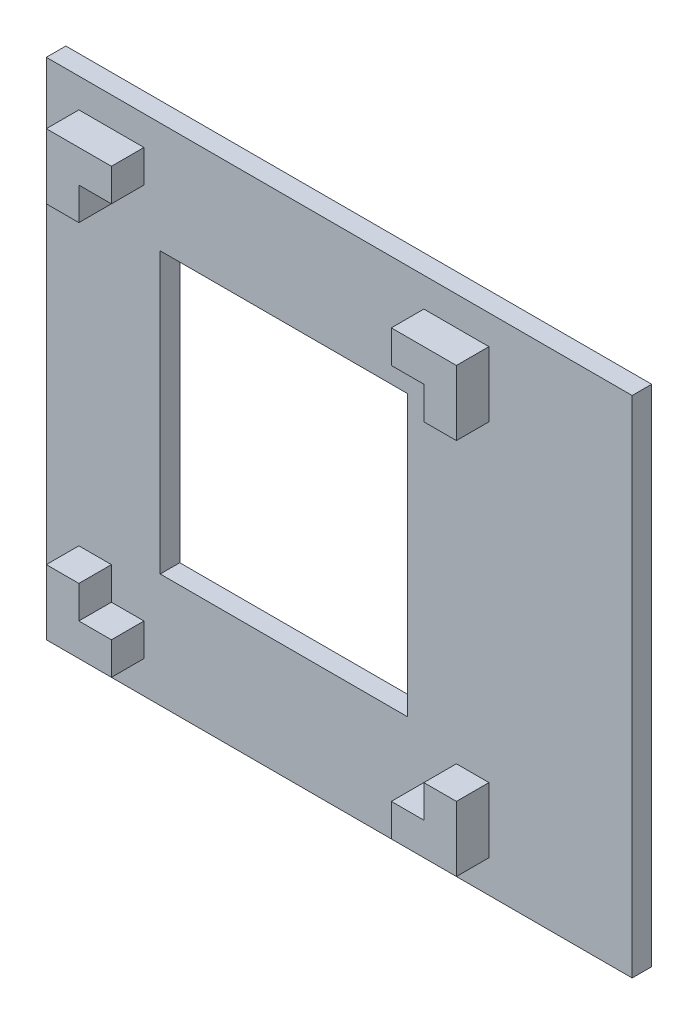
ISO-10303-21;
HEADER;
FILE_DESCRIPTION(('STEP AP214'),'2;1');
FILE_NAME('part.step','',(''),(''),'','','');
FILE_SCHEMA(('AUTOMOTIVE_DESIGN { 1 0 10303 214 1 1 1 1 }'));
ENDSEC;
DATA;
#1=APPLICATION_CONTEXT('core data for automotive mechanical design processes');
#2=APPLICATION_PROTOCOL_DEFINITION('international standard','automotive_design',2000,#1);
#3=PRODUCT_CONTEXT('',#1,'mechanical');
#4=PRODUCT('Part','Part','',(#3));
#5=PRODUCT_RELATED_PRODUCT_CATEGORY('part','',(#4));
#6=PRODUCT_DEFINITION_FORMATION('','',#4);
#7=PRODUCT_DEFINITION_CONTEXT('part definition',#1,'design');
#8=PRODUCT_DEFINITION('design','',#6,#7);
#9=PRODUCT_DEFINITION_SHAPE('','',#8);
#10=(LENGTH_UNIT() NAMED_UNIT(*) SI_UNIT(.MILLI.,.METRE.));
#11=(NAMED_UNIT(*) PLANE_ANGLE_UNIT() SI_UNIT($,.RADIAN.));
#12=(NAMED_UNIT(*) SI_UNIT($,.STERADIAN.) SOLID_ANGLE_UNIT());
#13=UNCERTAINTY_MEASURE_WITH_UNIT(LENGTH_MEASURE(1.E-05),#10,'distance_accuracy_value','');
#14=(GEOMETRIC_REPRESENTATION_CONTEXT(3) GLOBAL_UNCERTAINTY_ASSIGNED_CONTEXT((#13)) GLOBAL_UNIT_ASSIGNED_CONTEXT((#10,
#11,#12)) REPRESENTATION_CONTEXT('',''));
#15=CARTESIAN_POINT('',(0.,0.,0.));
#16=DIRECTION('',(0.,0.,1.));
#17=DIRECTION('',(1.,0.,0.));
#18=AXIS2_PLACEMENT_3D('',#15,#16,#17);
#19=CARTESIAN_POINT('',(0.,0.,3.));
#20=DIRECTION('',(0.,0.,1.));
#21=DIRECTION('',(1.,0.,0.));
#22=AXIS2_PLACEMENT_3D('',#19,#20,#21);
#23=PLANE('',#22);
#24=DIRECTION('',(1.,0.,0.));
#25=VECTOR('',#24,1.);
#26=CARTESIAN_POINT('',(0.,77.5,3.));
#27=LINE('',#26,#25);
#28=CARTESIAN_POINT('',(0.,77.5,3.));
#29=VERTEX_POINT('',#28);
#30=CARTESIAN_POINT('',(90.,77.5,3.));
#31=VERTEX_POINT('',#30);
#32=EDGE_CURVE('E376',#29,#31,#27,.T.);
#33=ORIENTED_EDGE('',*,*,#32,.F.);
#34=DIRECTION('',(0.,1.,0.));
#35=VECTOR('',#34,1.);
#36=CARTESIAN_POINT('',(0.,0.,3.));
#37=LINE('',#36,#35);
#38=CARTESIAN_POINT('',(0.,0.,3.));
#39=VERTEX_POINT('',#38);
#40=EDGE_CURVE('E379',#39,#29,#37,.T.);
#41=ORIENTED_EDGE('',*,*,#40,.F.);
#42=DIRECTION('',(1.,0.,0.));
#43=VECTOR('',#42,1.);
#44=CARTESIAN_POINT('',(0.,0.,3.));
#45=LINE('',#44,#43);
#46=CARTESIAN_POINT('',(90.,0.,3.));
#47=VERTEX_POINT('',#46);
#48=EDGE_CURVE('E383',#39,#47,#45,.T.);
#49=ORIENTED_EDGE('',*,*,#48,.T.);
#50=DIRECTION('',(0.,1.,0.));
#51=VECTOR('',#50,1.);
#52=CARTESIAN_POINT('',(90.,0.,3.));
#53=LINE('',#52,#51);
#54=EDGE_CURVE('E385',#47,#31,#53,.T.);
#55=ORIENTED_EDGE('',*,*,#54,.T.);
#56=EDGE_LOOP('',(#33,#41,#49,#55));
#57=FACE_BOUND('',#56,.T.);
#58=DIRECTION('',(0.,1.,0.));
#59=VECTOR('',#58,1.);
#60=CARTESIAN_POINT('',(15.,0.,3.));
#61=LINE('',#60,#59);
#62=CARTESIAN_POINT('',(15.,68.,3.));
#63=VERTEX_POINT('',#62);
#64=CARTESIAN_POINT('',(15.,73.,3.));
#65=VERTEX_POINT('',#64);
#66=EDGE_CURVE('E387',#63,#65,#61,.T.);
#67=ORIENTED_EDGE('',*,*,#66,.F.);
#68=DIRECTION('',(-1.,0.,0.));
#69=VECTOR('',#68,1.);
#70=CARTESIAN_POINT('',(0.,68.,3.));
#71=LINE('',#70,#69);
#72=CARTESIAN_POINT('',(10.,68.,3.));
#73=VERTEX_POINT('',#72);
#74=EDGE_CURVE('E390',#63,#73,#71,.T.);
#75=ORIENTED_EDGE('',*,*,#74,.T.);
#76=DIRECTION('',(0.,-1.,0.));
#77=VECTOR('',#76,1.);
#78=CARTESIAN_POINT('',(10.,0.,3.));
#79=LINE('',#78,#77);
#80=CARTESIAN_POINT('',(10.,63.,3.));
#81=VERTEX_POINT('',#80);
#82=EDGE_CURVE('E393',#73,#81,#79,.T.);
#83=ORIENTED_EDGE('',*,*,#82,.T.);
#84=DIRECTION('',(1.,0.,0.));
#85=VECTOR('',#84,1.);
#86=CARTESIAN_POINT('',(0.,63.,3.));
#87=LINE('',#86,#85);
#88=CARTESIAN_POINT('',(5.,63.,3.));
#89=VERTEX_POINT('',#88);
#90=EDGE_CURVE('E395',#89,#81,#87,.T.);
#91=ORIENTED_EDGE('',*,*,#90,.F.);
#92=DIRECTION('',(0.,-1.,0.));
#93=VECTOR('',#92,1.);
#94=CARTESIAN_POINT('',(5.,0.,3.));
#95=LINE('',#94,#93);
#96=CARTESIAN_POINT('',(5.,73.,3.));
#97=VERTEX_POINT('',#96);
#98=EDGE_CURVE('E398',#97,#89,#95,.T.);
#99=ORIENTED_EDGE('',*,*,#98,.F.);
#100=DIRECTION('',(-1.,0.,0.));
#101=VECTOR('',#100,1.);
#102=CARTESIAN_POINT('',(0.,73.,3.));
#103=LINE('',#102,#101);
#104=EDGE_CURVE('E401',#65,#97,#103,.T.);
#105=ORIENTED_EDGE('',*,*,#104,.F.);
#106=EDGE_LOOP('',(#67,#75,#83,#91,#99,#105));
#107=FACE_BOUND('',#106,.T.);
#108=DIRECTION('',(1.,0.,0.));
#109=VECTOR('',#108,1.);
#110=CARTESIAN_POINT('',(0.,10.,3.));
#111=LINE('',#110,#109);
#112=CARTESIAN_POINT('',(10.,10.,3.));
#113=VERTEX_POINT('',#112);
#114=CARTESIAN_POINT('',(15.,10.,3.));
#115=VERTEX_POINT('',#114);
#116=EDGE_CURVE('E404',#113,#115,#111,.T.);
#117=ORIENTED_EDGE('',*,*,#116,.T.);
#118=CARTESIAN_POINT('',(15.,5.,3.));
#119=VERTEX_POINT('',#118);
#120=EDGE_CURVE('E391',#119,#115,#61,.T.);
#121=ORIENTED_EDGE('',*,*,#120,.F.);
#122=DIRECTION('',(1.,0.,0.));
#123=VECTOR('',#122,1.);
#124=CARTESIAN_POINT('',(0.,5.,3.));
#125=LINE('',#124,#123);
#126=CARTESIAN_POINT('',(5.,5.,3.));
#127=VERTEX_POINT('',#126);
#128=EDGE_CURVE('E406',#127,#119,#125,.T.);
#129=ORIENTED_EDGE('',*,*,#128,.F.);
#130=DIRECTION('',(0.,1.,0.));
#131=VECTOR('',#130,1.);
#132=CARTESIAN_POINT('',(5.,0.,3.));
#133=LINE('',#132,#131);
#134=CARTESIAN_POINT('',(5.,15.,3.));
#135=VERTEX_POINT('',#134);
#136=EDGE_CURVE('E409',#127,#135,#133,.T.);
#137=ORIENTED_EDGE('',*,*,#136,.T.);
#138=DIRECTION('',(1.,0.,0.));
#139=VECTOR('',#138,1.);
#140=CARTESIAN_POINT('',(0.,15.,3.));
#141=LINE('',#140,#139);
#142=CARTESIAN_POINT('',(10.,15.,3.));
#143=VERTEX_POINT('',#142);
#144=EDGE_CURVE('E411',#135,#143,#141,.T.);
#145=ORIENTED_EDGE('',*,*,#144,.T.);
#146=DIRECTION('',(0.,1.,0.));
#147=VECTOR('',#146,1.);
#148=CARTESIAN_POINT('',(10.,0.,3.));
#149=LINE('',#148,#147);
#150=EDGE_CURVE('E413',#113,#143,#149,.T.);
#151=ORIENTED_EDGE('',*,*,#150,.F.);
#152=EDGE_LOOP('',(#117,#121,#129,#137,#145,#151));
#153=FACE_BOUND('',#152,.T.);
#154=DIRECTION('',(1.,0.,0.));
#155=VECTOR('',#154,1.);
#156=CARTESIAN_POINT('',(0.,68.,3.));
#157=LINE('',#156,#155);
#158=CARTESIAN_POINT('',(58.,68.,3.));
#159=VERTEX_POINT('',#158);
#160=CARTESIAN_POINT('',(63.,68.,3.));
#161=VERTEX_POINT('',#160);
#162=EDGE_CURVE('E416',#159,#161,#157,.T.);
#163=ORIENTED_EDGE('',*,*,#162,.F.);
#164=DIRECTION('',(0.,1.,0.));
#165=VECTOR('',#164,1.);
#166=CARTESIAN_POINT('',(58.,0.,3.));
#167=LINE('',#166,#165);
#168=CARTESIAN_POINT('',(58.,73.,3.));
#169=VERTEX_POINT('',#168);
#170=EDGE_CURVE('E418',#159,#169,#167,.T.);
#171=ORIENTED_EDGE('',*,*,#170,.T.);
#172=DIRECTION('',(1.,0.,0.));
#173=VECTOR('',#172,1.);
#174=CARTESIAN_POINT('',(0.,73.,3.));
#175=LINE('',#174,#173);
#176=CARTESIAN_POINT('',(68.,73.,3.));
#177=VERTEX_POINT('',#176);
#178=EDGE_CURVE('E421',#169,#177,#175,.T.);
#179=ORIENTED_EDGE('',*,*,#178,.T.);
#180=DIRECTION('',(0.,1.,0.));
#181=VECTOR('',#180,1.);
#182=CARTESIAN_POINT('',(68.,0.,3.));
#183=LINE('',#182,#181);
#184=CARTESIAN_POINT('',(68.,63.,3.));
#185=VERTEX_POINT('',#184);
#186=EDGE_CURVE('E424',#185,#177,#183,.T.);
#187=ORIENTED_EDGE('',*,*,#186,.F.);
#188=DIRECTION('',(-1.,0.,0.));
#189=VECTOR('',#188,1.);
#190=CARTESIAN_POINT('',(0.,63.,3.));
#191=LINE('',#190,#189);
#192=CARTESIAN_POINT('',(63.,63.,3.));
#193=VERTEX_POINT('',#192);
#194=EDGE_CURVE('E426',#185,#193,#191,.T.);
#195=ORIENTED_EDGE('',*,*,#194,.T.);
#196=DIRECTION('',(0.,-1.,0.));
#197=VECTOR('',#196,1.);
#198=CARTESIAN_POINT('',(63.,0.,3.));
#199=LINE('',#198,#197);
#200=EDGE_CURVE('E429',#161,#193,#199,.T.);
#201=ORIENTED_EDGE('',*,*,#200,.F.);
#202=EDGE_LOOP('',(#163,#171,#179,#187,#195,#201));
#203=FACE_BOUND('',#202,.T.);
#204=DIRECTION('',(0.,-1.,0.));
#205=VECTOR('',#204,1.);
#206=CARTESIAN_POINT('',(58.,0.,3.));
#207=LINE('',#206,#205);
#208=CARTESIAN_POINT('',(58.,10.,3.));
#209=VERTEX_POINT('',#208);
#210=CARTESIAN_POINT('',(58.,5.,3.));
#211=VERTEX_POINT('',#210);
#212=EDGE_CURVE('E431',#209,#211,#207,.T.);
#213=ORIENTED_EDGE('',*,*,#212,.F.);
#214=DIRECTION('',(1.,0.,0.));
#215=VECTOR('',#214,1.);
#216=CARTESIAN_POINT('',(0.,10.,3.));
#217=LINE('',#216,#215);
#218=CARTESIAN_POINT('',(63.,10.,3.));
#219=VERTEX_POINT('',#218);
#220=EDGE_CURVE('E434',#209,#219,#217,.T.);
#221=ORIENTED_EDGE('',*,*,#220,.T.);
#222=DIRECTION('',(0.,1.,0.));
#223=VECTOR('',#222,1.);
#224=CARTESIAN_POINT('',(63.,0.,3.));
#225=LINE('',#224,#223);
#226=CARTESIAN_POINT('',(63.,15.,3.));
#227=VERTEX_POINT('',#226);
#228=EDGE_CURVE('E436',#219,#227,#225,.T.);
#229=ORIENTED_EDGE('',*,*,#228,.T.);
#230=DIRECTION('',(-1.,0.,0.));
#231=VECTOR('',#230,1.);
#232=CARTESIAN_POINT('',(0.,15.,3.));
#233=LINE('',#232,#231);
#234=CARTESIAN_POINT('',(68.,15.,3.));
#235=VERTEX_POINT('',#234);
#236=EDGE_CURVE('E438',#235,#227,#233,.T.);
#237=ORIENTED_EDGE('',*,*,#236,.F.);
#238=DIRECTION('',(0.,1.,0.));
#239=VECTOR('',#238,1.);
#240=CARTESIAN_POINT('',(68.,0.,3.));
#241=LINE('',#240,#239);
#242=CARTESIAN_POINT('',(68.,5.,3.));
#243=VERTEX_POINT('',#242);
#244=EDGE_CURVE('E441',#243,#235,#241,.T.);
#245=ORIENTED_EDGE('',*,*,#244,.F.);
#246=DIRECTION('',(1.,0.,0.));
#247=VECTOR('',#246,1.);
#248=CARTESIAN_POINT('',(0.,5.,3.));
#249=LINE('',#248,#247);
#250=EDGE_CURVE('E444',#211,#243,#249,.T.);
#251=ORIENTED_EDGE('',*,*,#250,.F.);
#252=EDGE_LOOP('',(#213,#221,#229,#237,#245,#251));
#253=FACE_BOUND('',#252,.T.);
#254=DIRECTION('',(-1.,0.,0.));
#255=VECTOR('',#254,1.);
#256=CARTESIAN_POINT('',(0.,17.5,3.));
#257=LINE('',#256,#255);
#258=CARTESIAN_POINT('',(55.5,17.5,3.));
#259=VERTEX_POINT('',#258);
#260=CARTESIAN_POINT('',(17.5,17.5,3.));
#261=VERTEX_POINT('',#260);
#262=EDGE_CURVE('E268',#259,#261,#257,.T.);
#263=ORIENTED_EDGE('',*,*,#262,.T.);
#264=DIRECTION('',(0.,1.,0.));
#265=VECTOR('',#264,1.);
#266=CARTESIAN_POINT('',(17.5,0.,3.));
#267=LINE('',#266,#265);
#268=CARTESIAN_POINT('',(17.5,60.5,3.));
#269=VERTEX_POINT('',#268);
#270=EDGE_CURVE('E48',#261,#269,#267,.T.);
#271=ORIENTED_EDGE('',*,*,#270,.T.);
#272=DIRECTION('',(-1.,0.,0.));
#273=VECTOR('',#272,1.);
#274=CARTESIAN_POINT('',(0.,60.5,3.));
#275=LINE('',#274,#273);
#276=CARTESIAN_POINT('',(55.5,60.5,3.));
#277=VERTEX_POINT('',#276);
#278=EDGE_CURVE('E259',#277,#269,#275,.T.);
#279=ORIENTED_EDGE('',*,*,#278,.F.);
#280=DIRECTION('',(0.,1.,0.));
#281=VECTOR('',#280,1.);
#282=CARTESIAN_POINT('',(55.5,0.,3.));
#283=LINE('',#282,#281);
#284=EDGE_CURVE('E262',#259,#277,#283,.T.);
#285=ORIENTED_EDGE('',*,*,#284,.F.);
#286=EDGE_LOOP('',(#263,#271,#279,#285));
#287=FACE_BOUND('',#286,.T.);
#288=ADVANCED_FACE('F33',(#57,#107,#153,#203,#253,#287),#23,.T.);
#289=CARTESIAN_POINT('',(0.,0.,0.));
#290=DIRECTION('',(0.,0.,1.));
#291=DIRECTION('',(1.,0.,0.));
#292=AXIS2_PLACEMENT_3D('',#289,#290,#291);
#293=PLANE('',#292);
#294=DIRECTION('',(1.,0.,0.));
#295=VECTOR('',#294,1.);
#296=CARTESIAN_POINT('',(0.,77.5,0.));
#297=LINE('',#296,#295);
#298=CARTESIAN_POINT('',(0.,77.5,0.));
#299=VERTEX_POINT('',#298);
#300=CARTESIAN_POINT('',(90.,77.5,0.));
#301=VERTEX_POINT('',#300);
#302=EDGE_CURVE('E375',#299,#301,#297,.T.);
#303=ORIENTED_EDGE('',*,*,#302,.T.);
#304=DIRECTION('',(0.,1.,0.));
#305=VECTOR('',#304,1.);
#306=CARTESIAN_POINT('',(90.,0.,0.));
#307=LINE('',#306,#305);
#308=CARTESIAN_POINT('',(90.,0.,0.));
#309=VERTEX_POINT('',#308);
#310=EDGE_CURVE('E380',#309,#301,#307,.T.);
#311=ORIENTED_EDGE('',*,*,#310,.F.);
#312=DIRECTION('',(1.,0.,0.));
#313=VECTOR('',#312,1.);
#314=CARTESIAN_POINT('',(0.,0.,0.));
#315=LINE('',#314,#313);
#316=CARTESIAN_POINT('',(0.,0.,0.));
#317=VERTEX_POINT('',#316);
#318=EDGE_CURVE('E453',#317,#309,#315,.T.);
#319=ORIENTED_EDGE('',*,*,#318,.F.);
#320=DIRECTION('',(0.,1.,0.));
#321=VECTOR('',#320,1.);
#322=CARTESIAN_POINT('',(0.,0.,0.));
#323=LINE('',#322,#321);
#324=EDGE_CURVE('E450',#317,#299,#323,.T.);
#325=ORIENTED_EDGE('',*,*,#324,.T.);
#326=EDGE_LOOP('',(#303,#311,#319,#325));
#327=FACE_BOUND('',#326,.T.);
#328=DIRECTION('',(0.,1.,0.));
#329=VECTOR('',#328,1.);
#330=CARTESIAN_POINT('',(17.5,0.,0.));
#331=LINE('',#330,#329);
#332=CARTESIAN_POINT('',(17.5,17.5,0.));
#333=VERTEX_POINT('',#332);
#334=CARTESIAN_POINT('',(17.5,60.5,0.));
#335=VERTEX_POINT('',#334);
#336=EDGE_CURVE('E250',#333,#335,#331,.T.);
#337=ORIENTED_EDGE('',*,*,#336,.F.);
#338=DIRECTION('',(-1.,0.,0.));
#339=VECTOR('',#338,1.);
#340=CARTESIAN_POINT('',(0.,17.5,0.));
#341=LINE('',#340,#339);
#342=CARTESIAN_POINT('',(55.5,17.5,0.));
#343=VERTEX_POINT('',#342);
#344=EDGE_CURVE('E242',#343,#333,#341,.T.);
#345=ORIENTED_EDGE('',*,*,#344,.F.);
#346=DIRECTION('',(0.,1.,0.));
#347=VECTOR('',#346,1.);
#348=CARTESIAN_POINT('',(55.5,0.,0.));
#349=LINE('',#348,#347);
#350=CARTESIAN_POINT('',(55.5,60.5,0.));
#351=VERTEX_POINT('',#350);
#352=EDGE_CURVE('E56',#343,#351,#349,.T.);
#353=ORIENTED_EDGE('',*,*,#352,.T.);
#354=DIRECTION('',(-1.,0.,0.));
#355=VECTOR('',#354,1.);
#356=CARTESIAN_POINT('',(0.,60.5,0.));
#357=LINE('',#356,#355);
#358=EDGE_CURVE('E254',#351,#335,#357,.T.);
#359=ORIENTED_EDGE('',*,*,#358,.T.);
#360=EDGE_LOOP('',(#337,#345,#353,#359));
#361=FACE_BOUND('',#360,.T.);
#362=ADVANCED_FACE('F257',(#327,#361),#293,.F.);
#363=CARTESIAN_POINT('',(0.,10.,8.));
#364=DIRECTION('',(0.,1.,0.));
#365=DIRECTION('',(0.,0.,1.));
#366=AXIS2_PLACEMENT_3D('',#363,#364,#365);
#367=PLANE('',#366);
#368=ORIENTED_EDGE('',*,*,#116,.F.);
#369=DIRECTION('',(0.,0.,-1.));
#370=VECTOR('',#369,1.);
#371=CARTESIAN_POINT('',(10.,10.,8.));
#372=LINE('',#371,#370);
#373=CARTESIAN_POINT('',(10.,10.,8.));
#374=VERTEX_POINT('',#373);
#375=EDGE_CURVE('E11',#374,#113,#372,.T.);
#376=ORIENTED_EDGE('',*,*,#375,.F.);
#377=DIRECTION('',(1.,0.,0.));
#378=VECTOR('',#377,1.);
#379=CARTESIAN_POINT('',(0.,10.,8.));
#380=LINE('',#379,#378);
#381=CARTESIAN_POINT('',(15.,10.,8.));
#382=VERTEX_POINT('',#381);
#383=EDGE_CURVE('E465',#374,#382,#380,.T.);
#384=ORIENTED_EDGE('',*,*,#383,.T.);
#385=DIRECTION('',(0.,0.,-1.));
#386=VECTOR('',#385,1.);
#387=CARTESIAN_POINT('',(15.,10.,8.));
#388=LINE('',#387,#386);
#389=EDGE_CURVE('E480',#382,#115,#388,.T.);
#390=ORIENTED_EDGE('',*,*,#389,.T.);
#391=EDGE_LOOP('',(#368,#376,#384,#390));
#392=FACE_BOUND('',#391,.T.);
#393=ADVANCED_FACE('F35',(#392),#367,.T.);
#394=CARTESIAN_POINT('',(10.,0.,8.));
#395=DIRECTION('',(-1.,0.,0.));
#396=DIRECTION('',(0.,0.,1.));
#397=AXIS2_PLACEMENT_3D('',#394,#395,#396);
#398=PLANE('',#397);
#399=ORIENTED_EDGE('',*,*,#375,.T.);
#400=ORIENTED_EDGE('',*,*,#150,.T.);
#401=DIRECTION('',(0.,0.,-1.));
#402=VECTOR('',#401,1.);
#403=CARTESIAN_POINT('',(10.,15.,8.));
#404=LINE('',#403,#402);
#405=CARTESIAN_POINT('',(10.,15.,8.));
#406=VERTEX_POINT('',#405);
#407=EDGE_CURVE('E41',#406,#143,#404,.T.);
#408=ORIENTED_EDGE('',*,*,#407,.F.);
#409=DIRECTION('',(0.,1.,0.));
#410=VECTOR('',#409,1.);
#411=CARTESIAN_POINT('',(10.,0.,8.));
#412=LINE('',#411,#410);
#413=EDGE_CURVE('E468',#374,#406,#412,.T.);
#414=ORIENTED_EDGE('',*,*,#413,.F.);
#415=EDGE_LOOP('',(#399,#400,#408,#414));
#416=FACE_BOUND('',#415,.T.);
#417=ADVANCED_FACE('F499',(#416),#398,.F.);
#418=CARTESIAN_POINT('',(0.,15.,8.));
#419=DIRECTION('',(0.,1.,0.));
#420=DIRECTION('',(0.,0.,1.));
#421=AXIS2_PLACEMENT_3D('',#418,#419,#420);
#422=PLANE('',#421);
#423=ORIENTED_EDGE('',*,*,#144,.F.);
#424=DIRECTION('',(0.,0.,-1.));
#425=VECTOR('',#424,1.);
#426=CARTESIAN_POINT('',(5.,15.,8.));
#427=LINE('',#426,#425);
#428=CARTESIAN_POINT('',(5.,15.,8.));
#429=VERTEX_POINT('',#428);
#430=EDGE_CURVE('E489',#429,#135,#427,.T.);
#431=ORIENTED_EDGE('',*,*,#430,.F.);
#432=DIRECTION('',(1.,0.,0.));
#433=VECTOR('',#432,1.);
#434=CARTESIAN_POINT('',(0.,15.,8.));
#435=LINE('',#434,#433);
#436=EDGE_CURVE('E470',#429,#406,#435,.T.);
#437=ORIENTED_EDGE('',*,*,#436,.T.);
#438=ORIENTED_EDGE('',*,*,#407,.T.);
#439=EDGE_LOOP('',(#423,#431,#437,#438));
#440=FACE_BOUND('',#439,.T.);
#441=ADVANCED_FACE('F495',(#440),#422,.T.);
#442=CARTESIAN_POINT('',(5.,0.,8.));
#443=DIRECTION('',(-1.,0.,0.));
#444=DIRECTION('',(0.,-1.,0.));
#445=AXIS2_PLACEMENT_3D('',#442,#443,#444);
#446=PLANE('',#445);
#447=ORIENTED_EDGE('',*,*,#136,.F.);
#448=DIRECTION('',(0.,0.,-1.));
#449=VECTOR('',#448,1.);
#450=CARTESIAN_POINT('',(5.,5.,8.));
#451=LINE('',#450,#449);
#452=CARTESIAN_POINT('',(5.,5.,8.));
#453=VERTEX_POINT('',#452);
#454=EDGE_CURVE('E486',#453,#127,#451,.T.);
#455=ORIENTED_EDGE('',*,*,#454,.F.);
#456=DIRECTION('',(0.,1.,0.));
#457=VECTOR('',#456,1.);
#458=CARTESIAN_POINT('',(5.,0.,8.));
#459=LINE('',#458,#457);
#460=EDGE_CURVE('E473',#453,#429,#459,.T.);
#461=ORIENTED_EDGE('',*,*,#460,.T.);
#462=ORIENTED_EDGE('',*,*,#430,.T.);
#463=EDGE_LOOP('',(#447,#455,#461,#462));
#464=FACE_BOUND('',#463,.T.);
#465=ADVANCED_FACE('F517',(#464),#446,.T.);
#466=CARTESIAN_POINT('',(0.,5.,8.));
#467=DIRECTION('',(0.,1.,0.));
#468=DIRECTION('',(0.,0.,1.));
#469=AXIS2_PLACEMENT_3D('',#466,#467,#468);
#470=PLANE('',#469);
#471=ORIENTED_EDGE('',*,*,#454,.T.);
#472=ORIENTED_EDGE('',*,*,#128,.T.);
#473=DIRECTION('',(0.,0.,-1.));
#474=VECTOR('',#473,1.);
#475=CARTESIAN_POINT('',(15.,5.,8.));
#476=LINE('',#475,#474);
#477=CARTESIAN_POINT('',(15.,5.,8.));
#478=VERTEX_POINT('',#477);
#479=EDGE_CURVE('E483',#478,#119,#476,.T.);
#480=ORIENTED_EDGE('',*,*,#479,.F.);
#481=DIRECTION('',(1.,0.,0.));
#482=VECTOR('',#481,1.);
#483=CARTESIAN_POINT('',(0.,5.,8.));
#484=LINE('',#483,#482);
#485=EDGE_CURVE('E476',#453,#478,#484,.T.);
#486=ORIENTED_EDGE('',*,*,#485,.F.);
#487=EDGE_LOOP('',(#471,#472,#480,#486));
#488=FACE_BOUND('',#487,.T.);
#489=ADVANCED_FACE('F513',(#488),#470,.F.);
#490=CARTESIAN_POINT('',(15.,0.,8.));
#491=DIRECTION('',(-1.,0.,0.));
#492=DIRECTION('',(0.,0.,1.));
#493=AXIS2_PLACEMENT_3D('',#490,#491,#492);
#494=PLANE('',#493);
#495=ORIENTED_EDGE('',*,*,#479,.T.);
#496=ORIENTED_EDGE('',*,*,#120,.T.);
#497=ORIENTED_EDGE('',*,*,#389,.F.);
#498=DIRECTION('',(0.,1.,0.));
#499=VECTOR('',#498,1.);
#500=CARTESIAN_POINT('',(15.,0.,8.));
#501=LINE('',#500,#499);
#502=EDGE_CURVE('E478',#478,#382,#501,.T.);
#503=ORIENTED_EDGE('',*,*,#502,.F.);
#504=EDGE_LOOP('',(#495,#496,#497,#503));
#505=FACE_BOUND('',#504,.T.);
#506=ADVANCED_FACE('F509',(#505),#494,.F.);
#507=CARTESIAN_POINT('',(0.,0.,8.));
#508=DIRECTION('',(0.,0.,1.));
#509=DIRECTION('',(1.,0.,0.));
#510=AXIS2_PLACEMENT_3D('',#507,#508,#509);
#511=PLANE('',#510);
#512=ORIENTED_EDGE('',*,*,#383,.F.);
#513=ORIENTED_EDGE('',*,*,#413,.T.);
#514=ORIENTED_EDGE('',*,*,#436,.F.);
#515=ORIENTED_EDGE('',*,*,#460,.F.);
#516=ORIENTED_EDGE('',*,*,#485,.T.);
#517=ORIENTED_EDGE('',*,*,#502,.T.);
#518=EDGE_LOOP('',(#512,#513,#514,#515,#516,#517));
#519=FACE_BOUND('',#518,.T.);
#520=ADVANCED_FACE('F519',(#519),#511,.T.);
#521=CARTESIAN_POINT('',(0.,77.5,3.));
#522=DIRECTION('',(0.,1.,0.));
#523=DIRECTION('',(0.,0.,1.));
#524=AXIS2_PLACEMENT_3D('',#521,#522,#523);
#525=PLANE('',#524);
#526=ORIENTED_EDGE('',*,*,#302,.F.);
#527=DIRECTION('',(0.,0.,-1.));
#528=VECTOR('',#527,1.);
#529=CARTESIAN_POINT('',(0.,77.5,3.));
#530=LINE('',#529,#528);
#531=EDGE_CURVE('E463',#29,#299,#530,.T.);
#532=ORIENTED_EDGE('',*,*,#531,.F.);
#533=ORIENTED_EDGE('',*,*,#32,.T.);
#534=DIRECTION('',(0.,0.,-1.));
#535=VECTOR('',#534,1.);
#536=CARTESIAN_POINT('',(90.,77.5,3.));
#537=LINE('',#536,#535);
#538=EDGE_CURVE('E447',#31,#301,#537,.T.);
#539=ORIENTED_EDGE('',*,*,#538,.T.);
#540=EDGE_LOOP('',(#526,#532,#533,#539));
#541=FACE_BOUND('',#540,.T.);
#542=ADVANCED_FACE('F521',(#541),#525,.T.);
#543=CARTESIAN_POINT('',(0.,0.,3.));
#544=DIRECTION('',(-1.,0.,0.));
#545=DIRECTION('',(0.,0.,1.));
#546=AXIS2_PLACEMENT_3D('',#543,#544,#545);
#547=PLANE('',#546);
#548=ORIENTED_EDGE('',*,*,#324,.F.);
#549=DIRECTION('',(0.,0.,-1.));
#550=VECTOR('',#549,1.);
#551=CARTESIAN_POINT('',(0.,0.,3.));
#552=LINE('',#551,#550);
#553=EDGE_CURVE('E461',#39,#317,#552,.T.);
#554=ORIENTED_EDGE('',*,*,#553,.F.);
#555=ORIENTED_EDGE('',*,*,#40,.T.);
#556=ORIENTED_EDGE('',*,*,#531,.T.);
#557=EDGE_LOOP('',(#548,#554,#555,#556));
#558=FACE_BOUND('',#557,.T.);
#559=ADVANCED_FACE('F527',(#558),#547,.T.);
#560=CARTESIAN_POINT('',(0.,0.,3.));
#561=DIRECTION('',(0.,1.,0.));
#562=DIRECTION('',(0.,0.,1.));
#563=AXIS2_PLACEMENT_3D('',#560,#561,#562);
#564=PLANE('',#563);
#565=ORIENTED_EDGE('',*,*,#318,.T.);
#566=DIRECTION('',(0.,0.,-1.));
#567=VECTOR('',#566,1.);
#568=CARTESIAN_POINT('',(90.,0.,3.));
#569=LINE('',#568,#567);
#570=EDGE_CURVE('E458',#47,#309,#569,.T.);
#571=ORIENTED_EDGE('',*,*,#570,.F.);
#572=ORIENTED_EDGE('',*,*,#48,.F.);
#573=ORIENTED_EDGE('',*,*,#553,.T.);
#574=EDGE_LOOP('',(#565,#571,#572,#573));
#575=FACE_BOUND('',#574,.T.);
#576=ADVANCED_FACE('F548',(#575),#564,.F.);
#577=CARTESIAN_POINT('',(90.,0.,3.));
#578=DIRECTION('',(-1.,0.,0.));
#579=DIRECTION('',(0.,0.,1.));
#580=AXIS2_PLACEMENT_3D('',#577,#578,#579);
#581=PLANE('',#580);
#582=ORIENTED_EDGE('',*,*,#310,.T.);
#583=ORIENTED_EDGE('',*,*,#538,.F.);
#584=ORIENTED_EDGE('',*,*,#54,.F.);
#585=ORIENTED_EDGE('',*,*,#570,.T.);
#586=EDGE_LOOP('',(#582,#583,#584,#585));
#587=FACE_BOUND('',#586,.T.);
#588=ADVANCED_FACE('F545',(#587),#581,.F.);
#589=CARTESIAN_POINT('',(10.,0.,8.));
#590=DIRECTION('',(1.,0.,0.));
#591=DIRECTION('',(0.,0.,-1.));
#592=AXIS2_PLACEMENT_3D('',#589,#590,#591);
#593=PLANE('',#592);
#594=DIRECTION('',(0.,0.,-1.));
#595=VECTOR('',#594,1.);
#596=CARTESIAN_POINT('',(10.,63.,8.));
#597=LINE('',#596,#595);
#598=CARTESIAN_POINT('',(10.,63.,8.));
#599=VERTEX_POINT('',#598);
#600=EDGE_CURVE('E357',#599,#81,#597,.T.);
#601=ORIENTED_EDGE('',*,*,#600,.T.);
#602=ORIENTED_EDGE('',*,*,#82,.F.);
#603=DIRECTION('',(0.,0.,-1.));
#604=VECTOR('',#603,1.);
#605=CARTESIAN_POINT('',(10.,68.,8.));
#606=LINE('',#605,#604);
#607=CARTESIAN_POINT('',(10.,68.,8.));
#608=VERTEX_POINT('',#607);
#609=EDGE_CURVE('E372',#608,#73,#606,.T.);
#610=ORIENTED_EDGE('',*,*,#609,.F.);
#611=DIRECTION('',(0.,-1.,0.));
#612=VECTOR('',#611,1.);
#613=CARTESIAN_POINT('',(10.,0.,8.));
#614=LINE('',#613,#612);
#615=EDGE_CURVE('E342',#608,#599,#614,.T.);
#616=ORIENTED_EDGE('',*,*,#615,.T.);
#617=EDGE_LOOP('',(#601,#602,#610,#616));
#618=FACE_BOUND('',#617,.T.);
#619=ADVANCED_FACE('F543',(#618),#593,.T.);
#620=CARTESIAN_POINT('',(0.,68.,8.));
#621=DIRECTION('',(0.,-1.,0.));
#622=DIRECTION('',(0.,0.,-1.));
#623=AXIS2_PLACEMENT_3D('',#620,#621,#622);
#624=PLANE('',#623);
#625=ORIENTED_EDGE('',*,*,#609,.T.);
#626=ORIENTED_EDGE('',*,*,#74,.F.);
#627=DIRECTION('',(0.,0.,-1.));
#628=VECTOR('',#627,1.);
#629=CARTESIAN_POINT('',(15.,68.,8.));
#630=LINE('',#629,#628);
#631=CARTESIAN_POINT('',(15.,68.,8.));
#632=VERTEX_POINT('',#631);
#633=EDGE_CURVE('E369',#632,#63,#630,.T.);
#634=ORIENTED_EDGE('',*,*,#633,.F.);
#635=DIRECTION('',(-1.,0.,0.));
#636=VECTOR('',#635,1.);
#637=CARTESIAN_POINT('',(0.,68.,8.));
#638=LINE('',#637,#636);
#639=EDGE_CURVE('E345',#632,#608,#638,.T.);
#640=ORIENTED_EDGE('',*,*,#639,.T.);
#641=EDGE_LOOP('',(#625,#626,#634,#640));
#642=FACE_BOUND('',#641,.T.);
#643=ADVANCED_FACE('F582',(#642),#624,.T.);
#644=CARTESIAN_POINT('',(15.,0.,8.));
#645=DIRECTION('',(-1.,0.,0.));
#646=DIRECTION('',(0.,0.,1.));
#647=AXIS2_PLACEMENT_3D('',#644,#645,#646);
#648=PLANE('',#647);
#649=ORIENTED_EDGE('',*,*,#66,.T.);
#650=DIRECTION('',(0.,0.,-1.));
#651=VECTOR('',#650,1.);
#652=CARTESIAN_POINT('',(15.,73.,8.));
#653=LINE('',#652,#651);
#654=CARTESIAN_POINT('',(15.,73.,8.));
#655=VERTEX_POINT('',#654);
#656=EDGE_CURVE('E366',#655,#65,#653,.T.);
#657=ORIENTED_EDGE('',*,*,#656,.F.);
#658=DIRECTION('',(0.,1.,0.));
#659=VECTOR('',#658,1.);
#660=CARTESIAN_POINT('',(15.,0.,8.));
#661=LINE('',#660,#659);
#662=EDGE_CURVE('E348',#632,#655,#661,.T.);
#663=ORIENTED_EDGE('',*,*,#662,.F.);
#664=ORIENTED_EDGE('',*,*,#633,.T.);
#665=EDGE_LOOP('',(#649,#657,#663,#664));
#666=FACE_BOUND('',#665,.T.);
#667=ADVANCED_FACE('F589',(#666),#648,.F.);
#668=CARTESIAN_POINT('',(0.,73.,8.));
#669=DIRECTION('',(0.,-1.,0.));
#670=DIRECTION('',(0.,0.,-1.));
#671=AXIS2_PLACEMENT_3D('',#668,#669,#670);
#672=PLANE('',#671);
#673=ORIENTED_EDGE('',*,*,#104,.T.);
#674=DIRECTION('',(0.,0.,-1.));
#675=VECTOR('',#674,1.);
#676=CARTESIAN_POINT('',(5.,73.,8.));
#677=LINE('',#676,#675);
#678=CARTESIAN_POINT('',(5.,73.,8.));
#679=VERTEX_POINT('',#678);
#680=EDGE_CURVE('E363',#679,#97,#677,.T.);
#681=ORIENTED_EDGE('',*,*,#680,.F.);
#682=DIRECTION('',(-1.,0.,0.));
#683=VECTOR('',#682,1.);
#684=CARTESIAN_POINT('',(0.,73.,8.));
#685=LINE('',#684,#683);
#686=EDGE_CURVE('E350',#655,#679,#685,.T.);
#687=ORIENTED_EDGE('',*,*,#686,.F.);
#688=ORIENTED_EDGE('',*,*,#656,.T.);
#689=EDGE_LOOP('',(#673,#681,#687,#688));
#690=FACE_BOUND('',#689,.T.);
#691=ADVANCED_FACE('F596',(#690),#672,.F.);
#692=CARTESIAN_POINT('',(5.,0.,8.));
#693=DIRECTION('',(-1.,0.,0.));
#694=DIRECTION('',(0.,0.,1.));
#695=AXIS2_PLACEMENT_3D('',#692,#693,#694);
#696=PLANE('',#695);
#697=ORIENTED_EDGE('',*,*,#680,.T.);
#698=ORIENTED_EDGE('',*,*,#98,.T.);
#699=DIRECTION('',(0.,0.,-1.));
#700=VECTOR('',#699,1.);
#701=CARTESIAN_POINT('',(5.,63.,8.));
#702=LINE('',#701,#700);
#703=CARTESIAN_POINT('',(5.,63.,8.));
#704=VERTEX_POINT('',#703);
#705=EDGE_CURVE('E360',#704,#89,#702,.T.);
#706=ORIENTED_EDGE('',*,*,#705,.F.);
#707=DIRECTION('',(0.,1.,0.));
#708=VECTOR('',#707,1.);
#709=CARTESIAN_POINT('',(5.,0.,8.));
#710=LINE('',#709,#708);
#711=EDGE_CURVE('E352',#704,#679,#710,.T.);
#712=ORIENTED_EDGE('',*,*,#711,.T.);
#713=EDGE_LOOP('',(#697,#698,#706,#712));
#714=FACE_BOUND('',#713,.T.);
#715=ADVANCED_FACE('F604',(#714),#696,.T.);
#716=CARTESIAN_POINT('',(0.,63.,8.));
#717=DIRECTION('',(0.,1.,0.));
#718=DIRECTION('',(0.,0.,1.));
#719=AXIS2_PLACEMENT_3D('',#716,#717,#718);
#720=PLANE('',#719);
#721=ORIENTED_EDGE('',*,*,#90,.T.);
#722=ORIENTED_EDGE('',*,*,#600,.F.);
#723=DIRECTION('',(1.,0.,0.));
#724=VECTOR('',#723,1.);
#725=CARTESIAN_POINT('',(0.,63.,8.));
#726=LINE('',#725,#724);
#727=EDGE_CURVE('E355',#704,#599,#726,.T.);
#728=ORIENTED_EDGE('',*,*,#727,.F.);
#729=ORIENTED_EDGE('',*,*,#705,.T.);
#730=EDGE_LOOP('',(#721,#722,#728,#729));
#731=FACE_BOUND('',#730,.T.);
#732=ADVANCED_FACE('F612',(#731),#720,.F.);
#733=CARTESIAN_POINT('',(0.,0.,8.));
#734=DIRECTION('',(0.,0.,1.));
#735=DIRECTION('',(1.,0.,0.));
#736=AXIS2_PLACEMENT_3D('',#733,#734,#735);
#737=PLANE('',#736);
#738=ORIENTED_EDGE('',*,*,#615,.F.);
#739=ORIENTED_EDGE('',*,*,#639,.F.);
#740=ORIENTED_EDGE('',*,*,#662,.T.);
#741=ORIENTED_EDGE('',*,*,#686,.T.);
#742=ORIENTED_EDGE('',*,*,#711,.F.);
#743=ORIENTED_EDGE('',*,*,#727,.T.);
#744=EDGE_LOOP('',(#738,#739,#740,#741,#742,#743));
#745=FACE_BOUND('',#744,.T.);
#746=ADVANCED_FACE('F620',(#745),#737,.T.);
#747=CARTESIAN_POINT('',(0.,68.,8.));
#748=DIRECTION('',(0.,1.,0.));
#749=DIRECTION('',(0.,0.,1.));
#750=AXIS2_PLACEMENT_3D('',#747,#748,#749);
#751=PLANE('',#750);
#752=ORIENTED_EDGE('',*,*,#162,.T.);
#753=DIRECTION('',(0.,0.,-1.));
#754=VECTOR('',#753,1.);
#755=CARTESIAN_POINT('',(63.,68.,8.));
#756=LINE('',#755,#754);
#757=CARTESIAN_POINT('',(63.,68.,8.));
#758=VERTEX_POINT('',#757);
#759=EDGE_CURVE('E339',#758,#161,#756,.T.);
#760=ORIENTED_EDGE('',*,*,#759,.F.);
#761=DIRECTION('',(1.,0.,0.));
#762=VECTOR('',#761,1.);
#763=CARTESIAN_POINT('',(0.,68.,8.));
#764=LINE('',#763,#762);
#765=CARTESIAN_POINT('',(58.,68.,8.));
#766=VERTEX_POINT('',#765);
#767=EDGE_CURVE('E309',#766,#758,#764,.T.);
#768=ORIENTED_EDGE('',*,*,#767,.F.);
#769=DIRECTION('',(0.,0.,-1.));
#770=VECTOR('',#769,1.);
#771=CARTESIAN_POINT('',(58.,68.,8.));
#772=LINE('',#771,#770);
#773=EDGE_CURVE('E325',#766,#159,#772,.T.);
#774=ORIENTED_EDGE('',*,*,#773,.T.);
#775=EDGE_LOOP('',(#752,#760,#768,#774));
#776=FACE_BOUND('',#775,.T.);
#777=ADVANCED_FACE('F628',(#776),#751,.F.);
#778=CARTESIAN_POINT('',(63.,0.,8.));
#779=DIRECTION('',(1.,0.,0.));
#780=DIRECTION('',(0.,0.,-1.));
#781=AXIS2_PLACEMENT_3D('',#778,#779,#780);
#782=PLANE('',#781);
#783=ORIENTED_EDGE('',*,*,#200,.T.);
#784=DIRECTION('',(0.,0.,-1.));
#785=VECTOR('',#784,1.);
#786=CARTESIAN_POINT('',(63.,63.,8.));
#787=LINE('',#786,#785);
#788=CARTESIAN_POINT('',(63.,63.,8.));
#789=VERTEX_POINT('',#788);
#790=EDGE_CURVE('E336',#789,#193,#787,.T.);
#791=ORIENTED_EDGE('',*,*,#790,.F.);
#792=DIRECTION('',(0.,-1.,0.));
#793=VECTOR('',#792,1.);
#794=CARTESIAN_POINT('',(63.,0.,8.));
#795=LINE('',#794,#793);
#796=EDGE_CURVE('E312',#758,#789,#795,.T.);
#797=ORIENTED_EDGE('',*,*,#796,.F.);
#798=ORIENTED_EDGE('',*,*,#759,.T.);
#799=EDGE_LOOP('',(#783,#791,#797,#798));
#800=FACE_BOUND('',#799,.T.);
#801=ADVANCED_FACE('F636',(#800),#782,.F.);
#802=CARTESIAN_POINT('',(0.,63.,8.));
#803=DIRECTION('',(0.,-1.,0.));
#804=DIRECTION('',(0.,0.,-1.));
#805=AXIS2_PLACEMENT_3D('',#802,#803,#804);
#806=PLANE('',#805);
#807=ORIENTED_EDGE('',*,*,#790,.T.);
#808=ORIENTED_EDGE('',*,*,#194,.F.);
#809=DIRECTION('',(0.,0.,-1.));
#810=VECTOR('',#809,1.);
#811=CARTESIAN_POINT('',(68.,63.,8.));
#812=LINE('',#811,#810);
#813=CARTESIAN_POINT('',(68.,63.,8.));
#814=VERTEX_POINT('',#813);
#815=EDGE_CURVE('E333',#814,#185,#812,.T.);
#816=ORIENTED_EDGE('',*,*,#815,.F.);
#817=DIRECTION('',(-1.,0.,0.));
#818=VECTOR('',#817,1.);
#819=CARTESIAN_POINT('',(0.,63.,8.));
#820=LINE('',#819,#818);
#821=EDGE_CURVE('E314',#814,#789,#820,.T.);
#822=ORIENTED_EDGE('',*,*,#821,.T.);
#823=EDGE_LOOP('',(#807,#808,#816,#822));
#824=FACE_BOUND('',#823,.T.);
#825=ADVANCED_FACE('F644',(#824),#806,.T.);
#826=CARTESIAN_POINT('',(68.,0.,8.));
#827=DIRECTION('',(-1.,0.,0.));
#828=DIRECTION('',(0.,0.,1.));
#829=AXIS2_PLACEMENT_3D('',#826,#827,#828);
#830=PLANE('',#829);
#831=ORIENTED_EDGE('',*,*,#186,.T.);
#832=DIRECTION('',(0.,0.,-1.));
#833=VECTOR('',#832,1.);
#834=CARTESIAN_POINT('',(68.,73.,8.));
#835=LINE('',#834,#833);
#836=CARTESIAN_POINT('',(68.,73.,8.));
#837=VERTEX_POINT('',#836);
#838=EDGE_CURVE('E330',#837,#177,#835,.T.);
#839=ORIENTED_EDGE('',*,*,#838,.F.);
#840=DIRECTION('',(0.,1.,0.));
#841=VECTOR('',#840,1.);
#842=CARTESIAN_POINT('',(68.,0.,8.));
#843=LINE('',#842,#841);
#844=EDGE_CURVE('E317',#814,#837,#843,.T.);
#845=ORIENTED_EDGE('',*,*,#844,.F.);
#846=ORIENTED_EDGE('',*,*,#815,.T.);
#847=EDGE_LOOP('',(#831,#839,#845,#846));
#848=FACE_BOUND('',#847,.T.);
#849=ADVANCED_FACE('F652',(#848),#830,.F.);
#850=CARTESIAN_POINT('',(0.,73.,8.));
#851=DIRECTION('',(0.,1.,0.));
#852=DIRECTION('',(0.,0.,1.));
#853=AXIS2_PLACEMENT_3D('',#850,#851,#852);
#854=PLANE('',#853);
#855=ORIENTED_EDGE('',*,*,#838,.T.);
#856=ORIENTED_EDGE('',*,*,#178,.F.);
#857=DIRECTION('',(0.,0.,-1.));
#858=VECTOR('',#857,1.);
#859=CARTESIAN_POINT('',(58.,73.,8.));
#860=LINE('',#859,#858);
#861=CARTESIAN_POINT('',(58.,73.,8.));
#862=VERTEX_POINT('',#861);
#863=EDGE_CURVE('E328',#862,#169,#860,.T.);
#864=ORIENTED_EDGE('',*,*,#863,.F.);
#865=DIRECTION('',(1.,0.,0.));
#866=VECTOR('',#865,1.);
#867=CARTESIAN_POINT('',(0.,73.,8.));
#868=LINE('',#867,#866);
#869=EDGE_CURVE('E319',#862,#837,#868,.T.);
#870=ORIENTED_EDGE('',*,*,#869,.T.);
#871=EDGE_LOOP('',(#855,#856,#864,#870));
#872=FACE_BOUND('',#871,.T.);
#873=ADVANCED_FACE('F660',(#872),#854,.T.);
#874=CARTESIAN_POINT('',(58.,0.,8.));
#875=DIRECTION('',(-1.,0.,0.));
#876=DIRECTION('',(0.,0.,1.));
#877=AXIS2_PLACEMENT_3D('',#874,#875,#876);
#878=PLANE('',#877);
#879=ORIENTED_EDGE('',*,*,#863,.T.);
#880=ORIENTED_EDGE('',*,*,#170,.F.);
#881=ORIENTED_EDGE('',*,*,#773,.F.);
#882=DIRECTION('',(0.,1.,0.));
#883=VECTOR('',#882,1.);
#884=CARTESIAN_POINT('',(58.,0.,8.));
#885=LINE('',#884,#883);
#886=EDGE_CURVE('E322',#766,#862,#885,.T.);
#887=ORIENTED_EDGE('',*,*,#886,.T.);
#888=EDGE_LOOP('',(#879,#880,#881,#887));
#889=FACE_BOUND('',#888,.T.);
#890=ADVANCED_FACE('F668',(#889),#878,.T.);
#891=CARTESIAN_POINT('',(0.,0.,8.));
#892=DIRECTION('',(0.,0.,1.));
#893=DIRECTION('',(1.,0.,0.));
#894=AXIS2_PLACEMENT_3D('',#891,#892,#893);
#895=PLANE('',#894);
#896=ORIENTED_EDGE('',*,*,#767,.T.);
#897=ORIENTED_EDGE('',*,*,#796,.T.);
#898=ORIENTED_EDGE('',*,*,#821,.F.);
#899=ORIENTED_EDGE('',*,*,#844,.T.);
#900=ORIENTED_EDGE('',*,*,#869,.F.);
#901=ORIENTED_EDGE('',*,*,#886,.F.);
#902=EDGE_LOOP('',(#896,#897,#898,#899,#900,#901));
#903=FACE_BOUND('',#902,.T.);
#904=ADVANCED_FACE('F676',(#903),#895,.T.);
#905=CARTESIAN_POINT('',(63.,0.,8.));
#906=DIRECTION('',(-1.,0.,0.));
#907=DIRECTION('',(0.,0.,1.));
#908=AXIS2_PLACEMENT_3D('',#905,#906,#907);
#909=PLANE('',#908);
#910=DIRECTION('',(0.,0.,-1.));
#911=VECTOR('',#910,1.);
#912=CARTESIAN_POINT('',(63.,15.,8.));
#913=LINE('',#912,#911);
#914=CARTESIAN_POINT('',(63.,15.,8.));
#915=VERTEX_POINT('',#914);
#916=EDGE_CURVE('E291',#915,#227,#913,.T.);
#917=ORIENTED_EDGE('',*,*,#916,.T.);
#918=ORIENTED_EDGE('',*,*,#228,.F.);
#919=DIRECTION('',(0.,0.,-1.));
#920=VECTOR('',#919,1.);
#921=CARTESIAN_POINT('',(63.,10.,8.));
#922=LINE('',#921,#920);
#923=CARTESIAN_POINT('',(63.,10.,8.));
#924=VERTEX_POINT('',#923);
#925=EDGE_CURVE('E306',#924,#219,#922,.T.);
#926=ORIENTED_EDGE('',*,*,#925,.F.);
#927=DIRECTION('',(0.,1.,0.));
#928=VECTOR('',#927,1.);
#929=CARTESIAN_POINT('',(63.,0.,8.));
#930=LINE('',#929,#928);
#931=EDGE_CURVE('E274',#924,#915,#930,.T.);
#932=ORIENTED_EDGE('',*,*,#931,.T.);
#933=EDGE_LOOP('',(#917,#918,#926,#932));
#934=FACE_BOUND('',#933,.T.);
#935=ADVANCED_FACE('F684',(#934),#909,.T.);
#936=CARTESIAN_POINT('',(0.,10.,8.));
#937=DIRECTION('',(0.,1.,0.));
#938=DIRECTION('',(0.,0.,1.));
#939=AXIS2_PLACEMENT_3D('',#936,#937,#938);
#940=PLANE('',#939);
#941=ORIENTED_EDGE('',*,*,#925,.T.);
#942=ORIENTED_EDGE('',*,*,#220,.F.);
#943=DIRECTION('',(0.,0.,-1.));
#944=VECTOR('',#943,1.);
#945=CARTESIAN_POINT('',(58.,10.,8.));
#946=LINE('',#945,#944);
#947=CARTESIAN_POINT('',(58.,10.,8.));
#948=VERTEX_POINT('',#947);
#949=EDGE_CURVE('E303',#948,#209,#946,.T.);
#950=ORIENTED_EDGE('',*,*,#949,.F.);
#951=DIRECTION('',(1.,0.,0.));
#952=VECTOR('',#951,1.);
#953=CARTESIAN_POINT('',(0.,10.,8.));
#954=LINE('',#953,#952);
#955=EDGE_CURVE('E280',#948,#924,#954,.T.);
#956=ORIENTED_EDGE('',*,*,#955,.T.);
#957=EDGE_LOOP('',(#941,#942,#950,#956));
#958=FACE_BOUND('',#957,.T.);
#959=ADVANCED_FACE('F692',(#958),#940,.T.);
#960=CARTESIAN_POINT('',(58.,0.,8.));
#961=DIRECTION('',(1.,0.,0.));
#962=DIRECTION('',(0.,0.,-1.));
#963=AXIS2_PLACEMENT_3D('',#960,#961,#962);
#964=PLANE('',#963);
#965=ORIENTED_EDGE('',*,*,#212,.T.);
#966=DIRECTION('',(0.,0.,-1.));
#967=VECTOR('',#966,1.);
#968=CARTESIAN_POINT('',(58.,5.,8.));
#969=LINE('',#968,#967);
#970=CARTESIAN_POINT('',(58.,5.,8.));
#971=VERTEX_POINT('',#970);
#972=EDGE_CURVE('E300',#971,#211,#969,.T.);
#973=ORIENTED_EDGE('',*,*,#972,.F.);
#974=DIRECTION('',(0.,-1.,0.));
#975=VECTOR('',#974,1.);
#976=CARTESIAN_POINT('',(58.,0.,8.));
#977=LINE('',#976,#975);
#978=EDGE_CURVE('E283',#948,#971,#977,.T.);
#979=ORIENTED_EDGE('',*,*,#978,.F.);
#980=ORIENTED_EDGE('',*,*,#949,.T.);
#981=EDGE_LOOP('',(#965,#973,#979,#980));
#982=FACE_BOUND('',#981,.T.);
#983=ADVANCED_FACE('F700',(#982),#964,.F.);
#984=CARTESIAN_POINT('',(0.,5.,8.));
#985=DIRECTION('',(0.,1.,0.));
#986=DIRECTION('',(0.,0.,1.));
#987=AXIS2_PLACEMENT_3D('',#984,#985,#986);
#988=PLANE('',#987);
#989=ORIENTED_EDGE('',*,*,#250,.T.);
#990=DIRECTION('',(0.,0.,-1.));
#991=VECTOR('',#990,1.);
#992=CARTESIAN_POINT('',(68.,5.,8.));
#993=LINE('',#992,#991);
#994=CARTESIAN_POINT('',(68.,5.,8.));
#995=VERTEX_POINT('',#994);
#996=EDGE_CURVE('E297',#995,#243,#993,.T.);
#997=ORIENTED_EDGE('',*,*,#996,.F.);
#998=DIRECTION('',(1.,0.,0.));
#999=VECTOR('',#998,1.);
#1000=CARTESIAN_POINT('',(0.,5.,8.));
#1001=LINE('',#1000,#999);
#1002=EDGE_CURVE('E285',#971,#995,#1001,.T.);
#1003=ORIENTED_EDGE('',*,*,#1002,.F.);
#1004=ORIENTED_EDGE('',*,*,#972,.T.);
#1005=EDGE_LOOP('',(#989,#997,#1003,#1004));
#1006=FACE_BOUND('',#1005,.T.);
#1007=ADVANCED_FACE('F708',(#1006),#988,.F.);
#1008=CARTESIAN_POINT('',(68.,0.,8.));
#1009=DIRECTION('',(-1.,0.,0.));
#1010=DIRECTION('',(0.,0.,1.));
#1011=AXIS2_PLACEMENT_3D('',#1008,#1009,#1010);
#1012=PLANE('',#1011);
#1013=ORIENTED_EDGE('',*,*,#244,.T.);
#1014=DIRECTION('',(0.,0.,-1.));
#1015=VECTOR('',#1014,1.);
#1016=CARTESIAN_POINT('',(68.,15.,8.));
#1017=LINE('',#1016,#1015);
#1018=CARTESIAN_POINT('',(68.,15.,8.));
#1019=VERTEX_POINT('',#1018);
#1020=EDGE_CURVE('E294',#1019,#235,#1017,.T.);
#1021=ORIENTED_EDGE('',*,*,#1020,.F.);
#1022=DIRECTION('',(0.,1.,0.));
#1023=VECTOR('',#1022,1.);
#1024=CARTESIAN_POINT('',(68.,0.,8.));
#1025=LINE('',#1024,#1023);
#1026=EDGE_CURVE('E287',#995,#1019,#1025,.T.);
#1027=ORIENTED_EDGE('',*,*,#1026,.F.);
#1028=ORIENTED_EDGE('',*,*,#996,.T.);
#1029=EDGE_LOOP('',(#1013,#1021,#1027,#1028));
#1030=FACE_BOUND('',#1029,.T.);
#1031=ADVANCED_FACE('F716',(#1030),#1012,.F.);
#1032=CARTESIAN_POINT('',(0.,15.,8.));
#1033=DIRECTION('',(0.,-1.,0.));
#1034=DIRECTION('',(1.,0.,0.));
#1035=AXIS2_PLACEMENT_3D('',#1032,#1033,#1034);
#1036=PLANE('',#1035);
#1037=ORIENTED_EDGE('',*,*,#236,.T.);
#1038=ORIENTED_EDGE('',*,*,#916,.F.);
#1039=DIRECTION('',(-1.,0.,0.));
#1040=VECTOR('',#1039,1.);
#1041=CARTESIAN_POINT('',(0.,15.,8.));
#1042=LINE('',#1041,#1040);
#1043=EDGE_CURVE('E289',#1019,#915,#1042,.T.);
#1044=ORIENTED_EDGE('',*,*,#1043,.F.);
#1045=ORIENTED_EDGE('',*,*,#1020,.T.);
#1046=EDGE_LOOP('',(#1037,#1038,#1044,#1045));
#1047=FACE_BOUND('',#1046,.T.);
#1048=ADVANCED_FACE('F724',(#1047),#1036,.F.);
#1049=CARTESIAN_POINT('',(0.,0.,8.));
#1050=DIRECTION('',(0.,0.,1.));
#1051=DIRECTION('',(1.,0.,0.));
#1052=AXIS2_PLACEMENT_3D('',#1049,#1050,#1051);
#1053=PLANE('',#1052);
#1054=ORIENTED_EDGE('',*,*,#931,.F.);
#1055=ORIENTED_EDGE('',*,*,#955,.F.);
#1056=ORIENTED_EDGE('',*,*,#978,.T.);
#1057=ORIENTED_EDGE('',*,*,#1002,.T.);
#1058=ORIENTED_EDGE('',*,*,#1026,.T.);
#1059=ORIENTED_EDGE('',*,*,#1043,.T.);
#1060=EDGE_LOOP('',(#1054,#1055,#1056,#1057,#1058,#1059));
#1061=FACE_BOUND('',#1060,.T.);
#1062=ADVANCED_FACE('F732',(#1061),#1053,.T.);
#1063=CARTESIAN_POINT('',(17.5,0.,0.));
#1064=DIRECTION('',(1.,0.,0.));
#1065=DIRECTION('',(0.,1.,0.));
#1066=AXIS2_PLACEMENT_3D('',#1063,#1064,#1065);
#1067=PLANE('',#1066);
#1068=ORIENTED_EDGE('',*,*,#270,.F.);
#1069=DIRECTION('',(0.,0.,1.));
#1070=VECTOR('',#1069,1.);
#1071=CARTESIAN_POINT('',(17.5,17.5,0.));
#1072=LINE('',#1071,#1070);
#1073=EDGE_CURVE('E245',#333,#261,#1072,.T.);
#1074=ORIENTED_EDGE('',*,*,#1073,.F.);
#1075=ORIENTED_EDGE('',*,*,#336,.T.);
#1076=DIRECTION('',(0.,0.,1.));
#1077=VECTOR('',#1076,1.);
#1078=CARTESIAN_POINT('',(17.5,60.5,0.));
#1079=LINE('',#1078,#1077);
#1080=EDGE_CURVE('E272',#335,#269,#1079,.T.);
#1081=ORIENTED_EDGE('',*,*,#1080,.T.);
#1082=EDGE_LOOP('',(#1068,#1074,#1075,#1081));
#1083=FACE_BOUND('',#1082,.T.);
#1084=ADVANCED_FACE('F252',(#1083),#1067,.T.);
#1085=CARTESIAN_POINT('',(0.,60.5,0.));
#1086=DIRECTION('',(0.,1.,0.));
#1087=DIRECTION('',(-1.,0.,0.));
#1088=AXIS2_PLACEMENT_3D('',#1085,#1086,#1087);
#1089=PLANE('',#1088);
#1090=ORIENTED_EDGE('',*,*,#278,.T.);
#1091=ORIENTED_EDGE('',*,*,#1080,.F.);
#1092=ORIENTED_EDGE('',*,*,#358,.F.);
#1093=DIRECTION('',(0.,0.,1.));
#1094=VECTOR('',#1093,1.);
#1095=CARTESIAN_POINT('',(55.5,60.5,0.));
#1096=LINE('',#1095,#1094);
#1097=EDGE_CURVE('E275',#351,#277,#1096,.T.);
#1098=ORIENTED_EDGE('',*,*,#1097,.T.);
#1099=EDGE_LOOP('',(#1090,#1091,#1092,#1098));
#1100=FACE_BOUND('',#1099,.T.);
#1101=ADVANCED_FACE('F747',(#1100),#1089,.F.);
#1102=CARTESIAN_POINT('',(55.5,0.,0.));
#1103=DIRECTION('',(1.,0.,0.));
#1104=DIRECTION('',(0.,0.,-1.));
#1105=AXIS2_PLACEMENT_3D('',#1102,#1103,#1104);
#1106=PLANE('',#1105);
#1107=ORIENTED_EDGE('',*,*,#284,.T.);
#1108=ORIENTED_EDGE('',*,*,#1097,.F.);
#1109=ORIENTED_EDGE('',*,*,#352,.F.);
#1110=DIRECTION('',(0.,0.,1.));
#1111=VECTOR('',#1110,1.);
#1112=CARTESIAN_POINT('',(55.5,17.5,0.));
#1113=LINE('',#1112,#1111);
#1114=EDGE_CURVE('E247',#343,#259,#1113,.T.);
#1115=ORIENTED_EDGE('',*,*,#1114,.T.);
#1116=EDGE_LOOP('',(#1107,#1108,#1109,#1115));
#1117=FACE_BOUND('',#1116,.T.);
#1118=ADVANCED_FACE('F755',(#1117),#1106,.F.);
#1119=CARTESIAN_POINT('',(0.,17.5,0.));
#1120=DIRECTION('',(0.,1.,0.));
#1121=DIRECTION('',(-1.,0.,0.));
#1122=AXIS2_PLACEMENT_3D('',#1119,#1120,#1121);
#1123=PLANE('',#1122);
#1124=ORIENTED_EDGE('',*,*,#262,.F.);
#1125=ORIENTED_EDGE('',*,*,#1114,.F.);
#1126=ORIENTED_EDGE('',*,*,#344,.T.);
#1127=ORIENTED_EDGE('',*,*,#1073,.T.);
#1128=EDGE_LOOP('',(#1124,#1125,#1126,#1127));
#1129=FACE_BOUND('',#1128,.T.);
#1130=ADVANCED_FACE('F244',(#1129),#1123,.T.);
#1131=CLOSED_SHELL('',(#288,#362,#393,#417,#441,#465,#489,#506,#520,#542,#559,#576,#588,#619,
#643,#667,#691,#715,#732,#746,#777,#801,#825,#849,#873,#890,#904,#935,#959,#983,#1007,#1031,
#1048,#1062,#1084,#1101,#1118,#1130));
#1132=MANIFOLD_SOLID_BREP('B2',#1131);
#1133=ADVANCED_BREP_SHAPE_REPRESENTATION('',(#18,#1132),#14);
#1134=SHAPE_DEFINITION_REPRESENTATION(#9,#1133);
ENDSEC;
END-ISO-10303-21;
